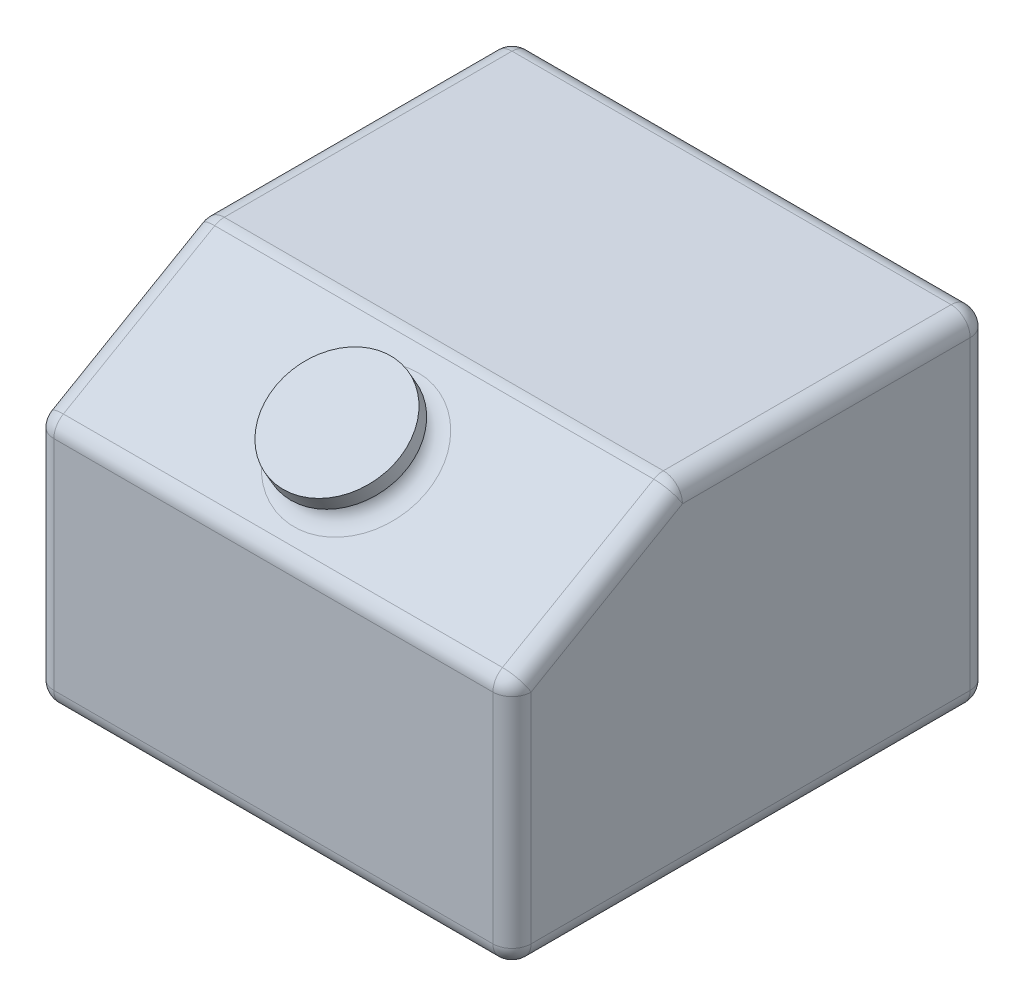
ISO-10303-21;
HEADER;
FILE_DESCRIPTION(('STEP AP214'),'2;1');
FILE_NAME('part.step','',(''),(''),'','','');
FILE_SCHEMA(('AUTOMOTIVE_DESIGN { 1 0 10303 214 1 1 1 1 }'));
ENDSEC;
DATA;
#1=APPLICATION_CONTEXT('core data for automotive mechanical design processes');
#2=APPLICATION_PROTOCOL_DEFINITION('international standard','automotive_design',2000,#1);
#3=PRODUCT_CONTEXT('',#1,'mechanical');
#4=PRODUCT('Part','Part','',(#3));
#5=PRODUCT_RELATED_PRODUCT_CATEGORY('part','',(#4));
#6=PRODUCT_DEFINITION_FORMATION('','',#4);
#7=PRODUCT_DEFINITION_CONTEXT('part definition',#1,'design');
#8=PRODUCT_DEFINITION('design','',#6,#7);
#9=PRODUCT_DEFINITION_SHAPE('','',#8);
#10=(LENGTH_UNIT() NAMED_UNIT(*) SI_UNIT(.MILLI.,.METRE.));
#11=(NAMED_UNIT(*) PLANE_ANGLE_UNIT() SI_UNIT($,.RADIAN.));
#12=(NAMED_UNIT(*) SI_UNIT($,.STERADIAN.) SOLID_ANGLE_UNIT());
#13=UNCERTAINTY_MEASURE_WITH_UNIT(LENGTH_MEASURE(1.E-05),#10,'distance_accuracy_value','');
#14=(GEOMETRIC_REPRESENTATION_CONTEXT(3) GLOBAL_UNCERTAINTY_ASSIGNED_CONTEXT((#13)) GLOBAL_UNIT_ASSIGNED_CONTEXT((#10,
#11,#12)) REPRESENTATION_CONTEXT('',''));
#15=CARTESIAN_POINT('',(0.,0.,0.));
#16=DIRECTION('',(0.,0.,1.));
#17=DIRECTION('',(1.,0.,0.));
#18=AXIS2_PLACEMENT_3D('',#15,#16,#17);
#19=CARTESIAN_POINT('',(125.,172.320508075689,-33.3012701892218));
#20=DIRECTION('',(0.,-0.866025403784438,-0.500000000000001));
#21=DIRECTION('',(0.,0.500000000000001,-0.866025403784438));
#22=AXIS2_PLACEMENT_3D('',#19,#20,#21);
#23=CYLINDRICAL_SURFACE('',#22,27.5);
#24=CARTESIAN_POINT('',(125.,163.660254037844,-38.3012701892219));
#25=DIRECTION('',(0.,-0.866025403784438,-0.500000000000001));
#26=DIRECTION('',(0.,0.500000000000001,-0.866025403784438));
#27=AXIS2_PLACEMENT_3D('',#24,#25,#26);
#28=CIRCLE('',#27,27.5);
#29=CARTESIAN_POINT('',(125.,177.410254037844,-62.116968793294));
#30=VERTEX_POINT('',#29);
#31=EDGE_CURVE('E230',#30,#30,#28,.F.);
#32=ORIENTED_EDGE('',*,*,#31,.T.);
#33=EDGE_LOOP('',(#32));
#34=FACE_BOUND('',#33,.T.);
#35=CARTESIAN_POINT('',(125.,165.392304845413,-37.3012701892219));
#36=DIRECTION('',(0.,0.866025403784438,0.500000000000001));
#37=DIRECTION('',(0.,-0.500000000000001,0.866025403784438));
#38=AXIS2_PLACEMENT_3D('',#35,#36,#37);
#39=CIRCLE('',#38,27.5);
#40=CARTESIAN_POINT('',(125.,151.642304845413,-13.4855715851499));
#41=VERTEX_POINT('',#40);
#42=EDGE_CURVE('E224',#41,#41,#39,.T.);
#43=ORIENTED_EDGE('',*,*,#42,.F.);
#44=EDGE_LOOP('',(#43));
#45=FACE_BOUND('',#44,.T.);
#46=ADVANCED_FACE('F34',(#34,#45),#23,.T.);
#47=CARTESIAN_POINT('',(0.,180.,0.));
#48=DIRECTION('',(1.,0.,0.));
#49=DIRECTION('',(0.,0.,-1.));
#50=AXIS2_PLACEMENT_3D('',#47,#48,#49);
#51=PLANE('',#50);
#52=DIRECTION('',(0.,-0.500000000000001,0.866025403784438));
#53=VECTOR('',#52,1.);
#54=CARTESIAN_POINT('',(0.,171.339745962156,-91.6025403784437));
#55=LINE('',#54,#53);
#56=CARTESIAN_POINT('',(0.,124.226497308104,-10.));
#57=VERTEX_POINT('',#56);
#58=CARTESIAN_POINT('',(0.,170.,-89.2820323027549));
#59=VERTEX_POINT('',#58);
#60=EDGE_CURVE('E260',#57,#59,#55,.F.);
#61=ORIENTED_EDGE('',*,*,#60,.T.);
#62=DIRECTION('',(0.,0.,1.));
#63=VECTOR('',#62,1.);
#64=CARTESIAN_POINT('',(0.,170.,0.));
#65=LINE('',#64,#63);
#66=CARTESIAN_POINT('',(0.,170.,-240.));
#67=VERTEX_POINT('',#66);
#68=EDGE_CURVE('E262',#59,#67,#65,.F.);
#69=ORIENTED_EDGE('',*,*,#68,.T.);
#70=DIRECTION('',(0.,-1.,0.));
#71=VECTOR('',#70,1.);
#72=CARTESIAN_POINT('',(0.,180.,-240.));
#73=LINE('',#72,#71);
#74=CARTESIAN_POINT('',(0.,10.,-240.));
#75=VERTEX_POINT('',#74);
#76=EDGE_CURVE('E258',#67,#75,#73,.T.);
#77=ORIENTED_EDGE('',*,*,#76,.T.);
#78=DIRECTION('',(0.,0.,1.));
#79=VECTOR('',#78,1.);
#80=CARTESIAN_POINT('',(0.,10.,0.));
#81=LINE('',#80,#79);
#82=CARTESIAN_POINT('',(0.,10.,-10.));
#83=VERTEX_POINT('',#82);
#84=EDGE_CURVE('E254',#75,#83,#81,.T.);
#85=ORIENTED_EDGE('',*,*,#84,.T.);
#86=DIRECTION('',(0.,-1.,0.));
#87=VECTOR('',#86,1.);
#88=CARTESIAN_POINT('',(0.,180.,-10.));
#89=LINE('',#88,#87);
#90=EDGE_CURVE('E256',#83,#57,#89,.F.);
#91=ORIENTED_EDGE('',*,*,#90,.T.);
#92=EDGE_LOOP('',(#61,#69,#77,#85,#91));
#93=FACE_BOUND('',#92,.T.);
#94=ADVANCED_FACE('F412',(#93),#51,.F.);
#95=CARTESIAN_POINT('',(0.,180.,0.));
#96=DIRECTION('',(0.,0.,-1.));
#97=DIRECTION('',(-1.,0.,0.));
#98=AXIS2_PLACEMENT_3D('',#95,#96,#97);
#99=PLANE('',#98);
#100=DIRECTION('',(1.,0.,0.));
#101=VECTOR('',#100,1.);
#102=CARTESIAN_POINT('',(0.,124.226497308104,0.));
#103=LINE('',#102,#101);
#104=CARTESIAN_POINT('',(240.,124.226497308104,0.));
#105=VERTEX_POINT('',#104);
#106=CARTESIAN_POINT('',(10.,124.226497308104,0.));
#107=VERTEX_POINT('',#106);
#108=EDGE_CURVE('E289',#105,#107,#103,.F.);
#109=ORIENTED_EDGE('',*,*,#108,.T.);
#110=DIRECTION('',(0.,-1.,0.));
#111=VECTOR('',#110,1.);
#112=CARTESIAN_POINT('',(10.,180.,0.));
#113=LINE('',#112,#111);
#114=CARTESIAN_POINT('',(10.,10.,0.));
#115=VERTEX_POINT('',#114);
#116=EDGE_CURVE('E291',#107,#115,#113,.T.);
#117=ORIENTED_EDGE('',*,*,#116,.T.);
#118=DIRECTION('',(1.,0.,0.));
#119=VECTOR('',#118,1.);
#120=CARTESIAN_POINT('',(250.,10.,0.));
#121=LINE('',#120,#119);
#122=CARTESIAN_POINT('',(240.,10.,0.));
#123=VERTEX_POINT('',#122);
#124=EDGE_CURVE('E285',#115,#123,#121,.T.);
#125=ORIENTED_EDGE('',*,*,#124,.T.);
#126=DIRECTION('',(0.,-1.,0.));
#127=VECTOR('',#126,1.);
#128=CARTESIAN_POINT('',(240.,180.,0.));
#129=LINE('',#128,#127);
#130=EDGE_CURVE('E287',#123,#105,#129,.F.);
#131=ORIENTED_EDGE('',*,*,#130,.T.);
#132=EDGE_LOOP('',(#109,#117,#125,#131));
#133=FACE_BOUND('',#132,.T.);
#134=ADVANCED_FACE('F391',(#133),#99,.F.);
#135=CARTESIAN_POINT('',(250.,180.,0.));
#136=DIRECTION('',(-1.,0.,0.));
#137=DIRECTION('',(0.,0.,1.));
#138=AXIS2_PLACEMENT_3D('',#135,#136,#137);
#139=PLANE('',#138);
#140=DIRECTION('',(0.,-1.,0.));
#141=VECTOR('',#140,1.);
#142=CARTESIAN_POINT('',(250.,180.,-240.));
#143=LINE('',#142,#141);
#144=CARTESIAN_POINT('',(250.,10.,-240.));
#145=VERTEX_POINT('',#144);
#146=CARTESIAN_POINT('',(250.,170.,-240.));
#147=VERTEX_POINT('',#146);
#148=EDGE_CURVE('E280',#145,#147,#143,.F.);
#149=ORIENTED_EDGE('',*,*,#148,.T.);
#150=DIRECTION('',(0.,0.,-1.));
#151=VECTOR('',#150,1.);
#152=CARTESIAN_POINT('',(250.,170.,0.));
#153=LINE('',#152,#151);
#154=CARTESIAN_POINT('',(250.,170.,-89.282032302755));
#155=VERTEX_POINT('',#154);
#156=EDGE_CURVE('E283',#147,#155,#153,.F.);
#157=ORIENTED_EDGE('',*,*,#156,.T.);
#158=DIRECTION('',(0.,0.500000000000001,-0.866025403784438));
#159=VECTOR('',#158,1.);
#160=CARTESIAN_POINT('',(250.,121.339745962156,-5.));
#161=LINE('',#160,#159);
#162=CARTESIAN_POINT('',(250.,124.226497308104,-10.));
#163=VERTEX_POINT('',#162);
#164=EDGE_CURVE('E278',#155,#163,#161,.F.);
#165=ORIENTED_EDGE('',*,*,#164,.T.);
#166=DIRECTION('',(0.,-1.,0.));
#167=VECTOR('',#166,1.);
#168=CARTESIAN_POINT('',(250.,180.,-10.));
#169=LINE('',#168,#167);
#170=CARTESIAN_POINT('',(250.,10.,-10.));
#171=VERTEX_POINT('',#170);
#172=EDGE_CURVE('E276',#163,#171,#169,.T.);
#173=ORIENTED_EDGE('',*,*,#172,.T.);
#174=DIRECTION('',(0.,0.,-1.));
#175=VECTOR('',#174,1.);
#176=CARTESIAN_POINT('',(250.,10.,-250.));
#177=LINE('',#176,#175);
#178=EDGE_CURVE('E274',#171,#145,#177,.T.);
#179=ORIENTED_EDGE('',*,*,#178,.T.);
#180=EDGE_LOOP('',(#149,#157,#165,#173,#179));
#181=FACE_BOUND('',#180,.T.);
#182=ADVANCED_FACE('F489',(#181),#139,.F.);
#183=CARTESIAN_POINT('',(0.,180.,-250.));
#184=DIRECTION('',(0.,0.,1.));
#185=DIRECTION('',(1.,0.,0.));
#186=AXIS2_PLACEMENT_3D('',#183,#184,#185);
#187=PLANE('',#186);
#188=DIRECTION('',(0.,-1.,0.));
#189=VECTOR('',#188,1.);
#190=CARTESIAN_POINT('',(10.,180.,-250.));
#191=LINE('',#190,#189);
#192=CARTESIAN_POINT('',(10.,10.,-250.));
#193=VERTEX_POINT('',#192);
#194=CARTESIAN_POINT('',(10.,170.,-250.));
#195=VERTEX_POINT('',#194);
#196=EDGE_CURVE('E269',#193,#195,#191,.F.);
#197=ORIENTED_EDGE('',*,*,#196,.T.);
#198=DIRECTION('',(-1.,0.,0.));
#199=VECTOR('',#198,1.);
#200=CARTESIAN_POINT('',(0.,170.,-250.));
#201=LINE('',#200,#199);
#202=CARTESIAN_POINT('',(240.,170.,-250.));
#203=VERTEX_POINT('',#202);
#204=EDGE_CURVE('E271',#195,#203,#201,.F.);
#205=ORIENTED_EDGE('',*,*,#204,.T.);
#206=DIRECTION('',(0.,-1.,0.));
#207=VECTOR('',#206,1.);
#208=CARTESIAN_POINT('',(240.,180.,-250.));
#209=LINE('',#208,#207);
#210=CARTESIAN_POINT('',(240.,10.,-250.));
#211=VERTEX_POINT('',#210);
#212=EDGE_CURVE('E267',#203,#211,#209,.T.);
#213=ORIENTED_EDGE('',*,*,#212,.T.);
#214=DIRECTION('',(-1.,0.,0.));
#215=VECTOR('',#214,1.);
#216=CARTESIAN_POINT('',(0.,10.,-250.));
#217=LINE('',#216,#215);
#218=EDGE_CURVE('E265',#211,#193,#217,.T.);
#219=ORIENTED_EDGE('',*,*,#218,.T.);
#220=EDGE_LOOP('',(#197,#205,#213,#219));
#221=FACE_BOUND('',#220,.T.);
#222=ADVANCED_FACE('F484',(#221),#187,.F.);
#223=CARTESIAN_POINT('',(0.,180.,0.));
#224=DIRECTION('',(0.,-1.,0.));
#225=DIRECTION('',(0.,0.,-1.));
#226=AXIS2_PLACEMENT_3D('',#223,#224,#225);
#227=PLANE('',#226);
#228=DIRECTION('',(0.,0.,1.));
#229=VECTOR('',#228,1.);
#230=CARTESIAN_POINT('',(10.,180.,0.));
#231=LINE('',#230,#229);
#232=CARTESIAN_POINT('',(10.,180.,-240.));
#233=VERTEX_POINT('',#232);
#234=CARTESIAN_POINT('',(10.,180.,-89.282032302755));
#235=VERTEX_POINT('',#234);
#236=EDGE_CURVE('E249',#233,#235,#231,.T.);
#237=ORIENTED_EDGE('',*,*,#236,.T.);
#238=DIRECTION('',(-1.,0.,0.));
#239=VECTOR('',#238,1.);
#240=CARTESIAN_POINT('',(250.,180.,-89.282032302755));
#241=LINE('',#240,#239);
#242=CARTESIAN_POINT('',(240.,180.,-89.282032302755));
#243=VERTEX_POINT('',#242);
#244=EDGE_CURVE('E251',#235,#243,#241,.F.);
#245=ORIENTED_EDGE('',*,*,#244,.T.);
#246=DIRECTION('',(0.,0.,-1.));
#247=VECTOR('',#246,1.);
#248=CARTESIAN_POINT('',(240.,180.,0.));
#249=LINE('',#248,#247);
#250=CARTESIAN_POINT('',(240.,180.,-240.));
#251=VERTEX_POINT('',#250);
#252=EDGE_CURVE('E245',#243,#251,#249,.T.);
#253=ORIENTED_EDGE('',*,*,#252,.T.);
#254=DIRECTION('',(-1.,0.,0.));
#255=VECTOR('',#254,1.);
#256=CARTESIAN_POINT('',(0.,180.,-240.));
#257=LINE('',#256,#255);
#258=EDGE_CURVE('E247',#251,#233,#257,.T.);
#259=ORIENTED_EDGE('',*,*,#258,.T.);
#260=EDGE_LOOP('',(#237,#245,#253,#259));
#261=FACE_BOUND('',#260,.T.);
#262=ADVANCED_FACE('F477',(#261),#227,.F.);
#263=CARTESIAN_POINT('',(0.,0.,0.));
#264=DIRECTION('',(0.,-1.,0.));
#265=DIRECTION('',(0.,0.,-1.));
#266=AXIS2_PLACEMENT_3D('',#263,#264,#265);
#267=PLANE('',#266);
#268=DIRECTION('',(0.,0.,-1.));
#269=VECTOR('',#268,1.);
#270=CARTESIAN_POINT('',(240.,0.,0.));
#271=LINE('',#270,#269);
#272=CARTESIAN_POINT('',(240.,0.,-240.));
#273=VERTEX_POINT('',#272);
#274=CARTESIAN_POINT('',(240.,0.,-10.));
#275=VERTEX_POINT('',#274);
#276=EDGE_CURVE('E43',#273,#275,#271,.F.);
#277=ORIENTED_EDGE('',*,*,#276,.T.);
#278=DIRECTION('',(1.,0.,0.));
#279=VECTOR('',#278,1.);
#280=CARTESIAN_POINT('',(0.,0.,-10.));
#281=LINE('',#280,#279);
#282=CARTESIAN_POINT('',(10.,0.,-10.));
#283=VERTEX_POINT('',#282);
#284=EDGE_CURVE('E11',#275,#283,#281,.F.);
#285=ORIENTED_EDGE('',*,*,#284,.T.);
#286=DIRECTION('',(0.,0.,1.));
#287=VECTOR('',#286,1.);
#288=CARTESIAN_POINT('',(10.,0.,-250.));
#289=LINE('',#288,#287);
#290=CARTESIAN_POINT('',(10.,0.,-240.));
#291=VERTEX_POINT('',#290);
#292=EDGE_CURVE('E294',#283,#291,#289,.F.);
#293=ORIENTED_EDGE('',*,*,#292,.T.);
#294=DIRECTION('',(-1.,0.,0.));
#295=VECTOR('',#294,1.);
#296=CARTESIAN_POINT('',(250.,0.,-240.));
#297=LINE('',#296,#295);
#298=EDGE_CURVE('E54',#291,#273,#297,.F.);
#299=ORIENTED_EDGE('',*,*,#298,.T.);
#300=EDGE_LOOP('',(#277,#285,#293,#299));
#301=FACE_BOUND('',#300,.T.);
#302=ADVANCED_FACE('F514',(#301),#267,.T.);
#303=CARTESIAN_POINT('',(0.,180.,-86.6025403784437));
#304=DIRECTION('',(0.,-0.866025403784438,-0.500000000000001));
#305=DIRECTION('',(1.,0.,0.));
#306=AXIS2_PLACEMENT_3D('',#303,#304,#305);
#307=PLANE('',#306);
#308=CARTESIAN_POINT('',(125.,155.,-43.301270189222));
#309=DIRECTION('',(0.,-0.866025403784438,-0.500000000000001));
#310=DIRECTION('',(0.,0.500000000000001,-0.866025403784438));
#311=AXIS2_PLACEMENT_3D('',#308,#309,#310);
#312=CIRCLE('',#311,37.5);
#313=CARTESIAN_POINT('',(125.,173.75,-75.7772228311384));
#314=VERTEX_POINT('',#313);
#315=EDGE_CURVE('E242',#314,#314,#312,.T.);
#316=ORIENTED_EDGE('',*,*,#315,.T.);
#317=EDGE_LOOP('',(#316));
#318=FACE_BOUND('',#317,.T.);
#319=DIRECTION('',(0.,-0.500000000000001,0.866025403784438));
#320=VECTOR('',#319,1.);
#321=CARTESIAN_POINT('',(240.,180.,-86.6025403784437));
#322=LINE('',#321,#320);
#323=CARTESIAN_POINT('',(240.,132.886751345948,-4.99999999999998));
#324=VERTEX_POINT('',#323);
#325=CARTESIAN_POINT('',(240.,178.660254037844,-84.2820323027549));
#326=VERTEX_POINT('',#325);
#327=EDGE_CURVE('E235',#324,#326,#322,.F.);
#328=ORIENTED_EDGE('',*,*,#327,.T.);
#329=DIRECTION('',(1.,0.,0.));
#330=VECTOR('',#329,1.);
#331=CARTESIAN_POINT('',(0.,178.660254037844,-84.2820323027549));
#332=LINE('',#331,#330);
#333=CARTESIAN_POINT('',(10.,178.660254037844,-84.2820323027549));
#334=VERTEX_POINT('',#333);
#335=EDGE_CURVE('E239',#326,#334,#332,.F.);
#336=ORIENTED_EDGE('',*,*,#335,.T.);
#337=DIRECTION('',(0.,0.500000000000001,-0.866025403784438));
#338=VECTOR('',#337,1.);
#339=CARTESIAN_POINT('',(10.,130.,0.));
#340=LINE('',#339,#338);
#341=CARTESIAN_POINT('',(10.,132.886751345948,-4.99999999999998));
#342=VERTEX_POINT('',#341);
#343=EDGE_CURVE('E237',#334,#342,#340,.F.);
#344=ORIENTED_EDGE('',*,*,#343,.T.);
#345=DIRECTION('',(-1.,0.,0.));
#346=VECTOR('',#345,1.);
#347=CARTESIAN_POINT('',(250.,132.886751345948,-4.99999999999998));
#348=LINE('',#347,#346);
#349=EDGE_CURVE('E233',#342,#324,#348,.F.);
#350=ORIENTED_EDGE('',*,*,#349,.T.);
#351=EDGE_LOOP('',(#328,#336,#344,#350));
#352=FACE_BOUND('',#351,.T.);
#353=ADVANCED_FACE('F463',(#318,#352),#307,.F.);
#354=CARTESIAN_POINT('',(125.,165.392304845413,-37.3012701892219));
#355=DIRECTION('',(0.,0.866025403784438,0.500000000000001));
#356=DIRECTION('',(0.,-0.500000000000001,0.866025403784438));
#357=AXIS2_PLACEMENT_3D('',#354,#355,#356);
#358=CYLINDRICAL_SURFACE('',#357,32.5);
#359=CARTESIAN_POINT('',(125.,165.392304845413,-37.3012701892219));
#360=DIRECTION('',(0.,0.866025403784438,0.500000000000001));
#361=DIRECTION('',(0.,-0.500000000000001,0.866025403784438));
#362=AXIS2_PLACEMENT_3D('',#359,#360,#361);
#363=CIRCLE('',#362,32.5);
#364=CARTESIAN_POINT('',(125.,149.142304845413,-9.15544456622765));
#365=VERTEX_POINT('',#364);
#366=EDGE_CURVE('E221',#365,#365,#363,.T.);
#367=ORIENTED_EDGE('',*,*,#366,.T.);
#368=EDGE_LOOP('',(#367));
#369=FACE_BOUND('',#368,.T.);
#370=CARTESIAN_POINT('',(125.,172.320508075689,-33.3012701892219));
#371=DIRECTION('',(0.,0.866025403784438,0.500000000000001));
#372=DIRECTION('',(0.,-0.500000000000001,0.866025403784438));
#373=AXIS2_PLACEMENT_3D('',#370,#371,#372);
#374=CIRCLE('',#373,32.5);
#375=CARTESIAN_POINT('',(125.,156.070508075689,-5.15544456622764));
#376=VERTEX_POINT('',#375);
#377=EDGE_CURVE('E225',#376,#376,#374,.T.);
#378=ORIENTED_EDGE('',*,*,#377,.F.);
#379=EDGE_LOOP('',(#378));
#380=FACE_BOUND('',#379,.T.);
#381=ADVANCED_FACE('F525',(#369,#380),#358,.T.);
#382=CARTESIAN_POINT('',(125.,165.392304845413,-37.3012701892219));
#383=DIRECTION('',(0.,0.866025403784438,0.500000000000001));
#384=DIRECTION('',(0.,-0.500000000000001,0.866025403784438));
#385=AXIS2_PLACEMENT_3D('',#382,#383,#384);
#386=PLANE('',#385);
#387=ORIENTED_EDGE('',*,*,#42,.T.);
#388=EDGE_LOOP('',(#387));
#389=FACE_BOUND('',#388,.T.);
#390=ORIENTED_EDGE('',*,*,#366,.F.);
#391=EDGE_LOOP('',(#390));
#392=FACE_BOUND('',#391,.T.);
#393=ADVANCED_FACE('F784',(#389,#392),#386,.F.);
#394=CARTESIAN_POINT('',(0.,114.820508075689,66.2916512459886));
#395=DIRECTION('',(0.,0.866025403784438,0.500000000000001));
#396=DIRECTION('',(0.,-0.500000000000001,0.866025403784438));
#397=AXIS2_PLACEMENT_3D('',#394,#395,#396);
#398=PLANE('',#397);
#399=ORIENTED_EDGE('',*,*,#377,.T.);
#400=EDGE_LOOP('',(#399));
#401=FACE_BOUND('',#400,.T.);
#402=ADVANCED_FACE('F510',(#401),#398,.T.);
#403=CARTESIAN_POINT('',(125.,163.660254037844,-38.3012701892219));
#404=DIRECTION('',(0.,-0.866025403784438,-0.500000000000001));
#405=DIRECTION('',(0.,0.500000000000001,-0.866025403784438));
#406=AXIS2_PLACEMENT_3D('',#403,#404,#405);
#407=TOROIDAL_SURFACE('',#406,37.5,10.);
#408=ORIENTED_EDGE('',*,*,#315,.F.);
#409=EDGE_LOOP('',(#408));
#410=FACE_BOUND('',#409,.T.);
#411=ORIENTED_EDGE('',*,*,#31,.F.);
#412=EDGE_LOOP('',(#411));
#413=FACE_BOUND('',#412,.T.);
#414=ADVANCED_FACE('F527',(#410,#413),#407,.F.);
#415=CARTESIAN_POINT('',(10.,10.,0.));
#416=DIRECTION('',(0.,0.,-1.));
#417=DIRECTION('',(-1.,0.,0.));
#418=AXIS2_PLACEMENT_3D('',#415,#416,#417);
#419=CYLINDRICAL_SURFACE('',#418,10.);
#420=CARTESIAN_POINT('',(10.,10.,-240.));
#421=DIRECTION('',(0.,0.,-1.));
#422=DIRECTION('',(-1.,0.,0.));
#423=AXIS2_PLACEMENT_3D('',#420,#421,#422);
#424=CIRCLE('',#423,10.);
#425=EDGE_CURVE('E373',#291,#75,#424,.T.);
#426=ORIENTED_EDGE('',*,*,#425,.F.);
#427=ORIENTED_EDGE('',*,*,#292,.F.);
#428=CARTESIAN_POINT('',(10.,10.,-10.));
#429=DIRECTION('',(0.,0.,1.));
#430=DIRECTION('',(1.,0.,0.));
#431=AXIS2_PLACEMENT_3D('',#428,#429,#430);
#432=CIRCLE('',#431,10.);
#433=EDGE_CURVE('E375',#83,#283,#432,.T.);
#434=ORIENTED_EDGE('',*,*,#433,.F.);
#435=ORIENTED_EDGE('',*,*,#84,.F.);
#436=EDGE_LOOP('',(#426,#427,#434,#435));
#437=FACE_BOUND('',#436,.T.);
#438=ADVANCED_FACE('F36',(#437),#419,.T.);
#439=CARTESIAN_POINT('',(0.,10.,-240.));
#440=DIRECTION('',(1.,0.,0.));
#441=DIRECTION('',(0.,0.,-1.));
#442=AXIS2_PLACEMENT_3D('',#439,#440,#441);
#443=CYLINDRICAL_SURFACE('',#442,10.);
#444=CARTESIAN_POINT('',(240.,10.,-240.));
#445=DIRECTION('',(1.,0.,0.));
#446=DIRECTION('',(0.,0.,-1.));
#447=AXIS2_PLACEMENT_3D('',#444,#445,#446);
#448=CIRCLE('',#447,10.);
#449=EDGE_CURVE('E367',#273,#211,#448,.T.);
#450=ORIENTED_EDGE('',*,*,#449,.F.);
#451=ORIENTED_EDGE('',*,*,#298,.F.);
#452=CARTESIAN_POINT('',(10.,10.,-240.));
#453=DIRECTION('',(-1.,0.,0.));
#454=DIRECTION('',(0.,0.,1.));
#455=AXIS2_PLACEMENT_3D('',#452,#453,#454);
#456=CIRCLE('',#455,10.);
#457=EDGE_CURVE('E370',#193,#291,#456,.T.);
#458=ORIENTED_EDGE('',*,*,#457,.F.);
#459=ORIENTED_EDGE('',*,*,#218,.F.);
#460=EDGE_LOOP('',(#450,#451,#458,#459));
#461=FACE_BOUND('',#460,.T.);
#462=ADVANCED_FACE('F437',(#461),#443,.T.);
#463=CARTESIAN_POINT('',(240.,10.,0.));
#464=DIRECTION('',(0.,0.,1.));
#465=DIRECTION('',(1.,0.,0.));
#466=AXIS2_PLACEMENT_3D('',#463,#464,#465);
#467=CYLINDRICAL_SURFACE('',#466,10.);
#468=CARTESIAN_POINT('',(240.,10.,-10.));
#469=DIRECTION('',(0.,0.,1.));
#470=DIRECTION('',(1.,0.,0.));
#471=AXIS2_PLACEMENT_3D('',#468,#469,#470);
#472=CIRCLE('',#471,10.);
#473=EDGE_CURVE('E361',#275,#171,#472,.T.);
#474=ORIENTED_EDGE('',*,*,#473,.F.);
#475=ORIENTED_EDGE('',*,*,#276,.F.);
#476=CARTESIAN_POINT('',(240.,10.,-240.));
#477=DIRECTION('',(0.,0.,-1.));
#478=DIRECTION('',(-1.,0.,0.));
#479=AXIS2_PLACEMENT_3D('',#476,#477,#478);
#480=CIRCLE('',#479,10.);
#481=EDGE_CURVE('E364',#145,#273,#480,.T.);
#482=ORIENTED_EDGE('',*,*,#481,.F.);
#483=ORIENTED_EDGE('',*,*,#178,.F.);
#484=EDGE_LOOP('',(#474,#475,#482,#483));
#485=FACE_BOUND('',#484,.T.);
#486=ADVANCED_FACE('F446',(#485),#467,.T.);
#487=CARTESIAN_POINT('',(0.,10.,-10.));
#488=DIRECTION('',(-1.,0.,0.));
#489=DIRECTION('',(0.,0.,1.));
#490=AXIS2_PLACEMENT_3D('',#487,#488,#489);
#491=CYLINDRICAL_SURFACE('',#490,10.);
#492=CARTESIAN_POINT('',(10.,10.,-10.));
#493=DIRECTION('',(-1.,0.,0.));
#494=DIRECTION('',(0.,0.,1.));
#495=AXIS2_PLACEMENT_3D('',#492,#493,#494);
#496=CIRCLE('',#495,10.);
#497=EDGE_CURVE('E38',#283,#115,#496,.T.);
#498=ORIENTED_EDGE('',*,*,#497,.F.);
#499=ORIENTED_EDGE('',*,*,#284,.F.);
#500=CARTESIAN_POINT('',(240.,10.,-10.));
#501=DIRECTION('',(1.,0.,0.));
#502=DIRECTION('',(0.,0.,-1.));
#503=AXIS2_PLACEMENT_3D('',#500,#501,#502);
#504=CIRCLE('',#503,10.);
#505=EDGE_CURVE('E358',#123,#275,#504,.T.);
#506=ORIENTED_EDGE('',*,*,#505,.F.);
#507=ORIENTED_EDGE('',*,*,#124,.F.);
#508=EDGE_LOOP('',(#498,#499,#506,#507));
#509=FACE_BOUND('',#508,.T.);
#510=ADVANCED_FACE('F387',(#509),#491,.T.);
#511=CARTESIAN_POINT('',(10.,10.,-10.));
#512=DIRECTION('',(0.,0.,1.));
#513=DIRECTION('',(1.,0.,0.));
#514=AXIS2_PLACEMENT_3D('',#511,#512,#513);
#515=SPHERICAL_SURFACE('',#514,10.);
#516=ORIENTED_EDGE('',*,*,#433,.T.);
#517=ORIENTED_EDGE('',*,*,#497,.T.);
#518=CARTESIAN_POINT('',(10.,10.,-10.));
#519=DIRECTION('',(0.,-1.,0.));
#520=DIRECTION('',(0.,0.,-1.));
#521=AXIS2_PLACEMENT_3D('',#518,#519,#520);
#522=CIRCLE('',#521,10.);
#523=EDGE_CURVE('E356',#83,#115,#522,.F.);
#524=ORIENTED_EDGE('',*,*,#523,.F.);
#525=EDGE_LOOP('',(#516,#517,#524));
#526=FACE_BOUND('',#525,.T.);
#527=ADVANCED_FACE('F382',(#526),#515,.T.);
#528=CARTESIAN_POINT('',(10.,10.,-240.));
#529=DIRECTION('',(0.,0.,1.));
#530=DIRECTION('',(1.,0.,0.));
#531=AXIS2_PLACEMENT_3D('',#528,#529,#530);
#532=SPHERICAL_SURFACE('',#531,10.);
#533=ORIENTED_EDGE('',*,*,#457,.T.);
#534=ORIENTED_EDGE('',*,*,#425,.T.);
#535=CARTESIAN_POINT('',(10.,10.,-240.));
#536=DIRECTION('',(0.,-1.,0.));
#537=DIRECTION('',(0.,0.,-1.));
#538=AXIS2_PLACEMENT_3D('',#535,#536,#537);
#539=CIRCLE('',#538,10.);
#540=EDGE_CURVE('E353',#193,#75,#539,.F.);
#541=ORIENTED_EDGE('',*,*,#540,.F.);
#542=EDGE_LOOP('',(#533,#534,#541));
#543=FACE_BOUND('',#542,.T.);
#544=ADVANCED_FACE('F432',(#543),#532,.T.);
#545=CARTESIAN_POINT('',(240.,10.,-240.));
#546=DIRECTION('',(0.,0.,1.));
#547=DIRECTION('',(1.,0.,0.));
#548=AXIS2_PLACEMENT_3D('',#545,#546,#547);
#549=SPHERICAL_SURFACE('',#548,10.);
#550=ORIENTED_EDGE('',*,*,#481,.T.);
#551=ORIENTED_EDGE('',*,*,#449,.T.);
#552=CARTESIAN_POINT('',(240.,10.,-240.));
#553=DIRECTION('',(0.,-1.,0.));
#554=DIRECTION('',(0.,0.,-1.));
#555=AXIS2_PLACEMENT_3D('',#552,#553,#554);
#556=CIRCLE('',#555,10.);
#557=EDGE_CURVE('E350',#145,#211,#556,.F.);
#558=ORIENTED_EDGE('',*,*,#557,.F.);
#559=EDGE_LOOP('',(#550,#551,#558));
#560=FACE_BOUND('',#559,.T.);
#561=ADVANCED_FACE('F441',(#560),#549,.T.);
#562=CARTESIAN_POINT('',(240.,10.,-10.));
#563=DIRECTION('',(0.,0.,1.));
#564=DIRECTION('',(1.,0.,0.));
#565=AXIS2_PLACEMENT_3D('',#562,#563,#564);
#566=SPHERICAL_SURFACE('',#565,10.);
#567=ORIENTED_EDGE('',*,*,#505,.T.);
#568=ORIENTED_EDGE('',*,*,#473,.T.);
#569=CARTESIAN_POINT('',(240.,10.,-10.));
#570=DIRECTION('',(0.,-1.,0.));
#571=DIRECTION('',(0.,0.,-1.));
#572=AXIS2_PLACEMENT_3D('',#569,#570,#571);
#573=CIRCLE('',#572,10.);
#574=EDGE_CURVE('E347',#123,#171,#573,.F.);
#575=ORIENTED_EDGE('',*,*,#574,.F.);
#576=EDGE_LOOP('',(#567,#568,#575));
#577=FACE_BOUND('',#576,.T.);
#578=ADVANCED_FACE('F448',(#577),#566,.T.);
#579=CARTESIAN_POINT('',(10.,180.,-10.));
#580=DIRECTION('',(0.,-1.,0.));
#581=DIRECTION('',(0.,0.,-1.));
#582=AXIS2_PLACEMENT_3D('',#579,#580,#581);
#583=CYLINDRICAL_SURFACE('',#582,10.);
#584=ORIENTED_EDGE('',*,*,#523,.T.);
#585=ORIENTED_EDGE('',*,*,#116,.F.);
#586=CARTESIAN_POINT('',(10.,124.226497308104,-10.));
#587=DIRECTION('',(0.,1.,0.));
#588=DIRECTION('',(0.,0.,1.));
#589=AXIS2_PLACEMENT_3D('',#586,#587,#588);
#590=CIRCLE('',#589,10.);
#591=EDGE_CURVE('E341',#57,#107,#590,.T.);
#592=ORIENTED_EDGE('',*,*,#591,.F.);
#593=ORIENTED_EDGE('',*,*,#90,.F.);
#594=EDGE_LOOP('',(#584,#585,#592,#593));
#595=FACE_BOUND('',#594,.T.);
#596=ADVANCED_FACE('F396',(#595),#583,.T.);
#597=CARTESIAN_POINT('',(10.,180.,-240.));
#598=DIRECTION('',(0.,-1.,0.));
#599=DIRECTION('',(0.,0.,-1.));
#600=AXIS2_PLACEMENT_3D('',#597,#598,#599);
#601=CYLINDRICAL_SURFACE('',#600,10.);
#602=ORIENTED_EDGE('',*,*,#540,.T.);
#603=ORIENTED_EDGE('',*,*,#76,.F.);
#604=CARTESIAN_POINT('',(10.,170.,-240.));
#605=DIRECTION('',(0.,1.,0.));
#606=DIRECTION('',(0.,0.,1.));
#607=AXIS2_PLACEMENT_3D('',#604,#605,#606);
#608=CIRCLE('',#607,10.);
#609=EDGE_CURVE('E338',#195,#67,#608,.T.);
#610=ORIENTED_EDGE('',*,*,#609,.F.);
#611=ORIENTED_EDGE('',*,*,#196,.F.);
#612=EDGE_LOOP('',(#602,#603,#610,#611));
#613=FACE_BOUND('',#612,.T.);
#614=ADVANCED_FACE('F426',(#613),#601,.T.);
#615=CARTESIAN_POINT('',(0.,170.,-240.));
#616=DIRECTION('',(-1.,0.,0.));
#617=DIRECTION('',(0.,0.,1.));
#618=AXIS2_PLACEMENT_3D('',#615,#616,#617);
#619=CYLINDRICAL_SURFACE('',#618,10.);
#620=CARTESIAN_POINT('',(240.,170.,-240.));
#621=DIRECTION('',(1.,0.,0.));
#622=DIRECTION('',(0.,0.,-1.));
#623=AXIS2_PLACEMENT_3D('',#620,#621,#622);
#624=CIRCLE('',#623,10.);
#625=EDGE_CURVE('E332',#203,#251,#624,.T.);
#626=ORIENTED_EDGE('',*,*,#625,.F.);
#627=ORIENTED_EDGE('',*,*,#204,.F.);
#628=CARTESIAN_POINT('',(10.,170.,-240.));
#629=DIRECTION('',(-1.,0.,0.));
#630=DIRECTION('',(0.,0.,1.));
#631=AXIS2_PLACEMENT_3D('',#628,#629,#630);
#632=CIRCLE('',#631,10.);
#633=EDGE_CURVE('E335',#233,#195,#632,.T.);
#634=ORIENTED_EDGE('',*,*,#633,.F.);
#635=ORIENTED_EDGE('',*,*,#258,.F.);
#636=EDGE_LOOP('',(#626,#627,#634,#635));
#637=FACE_BOUND('',#636,.T.);
#638=ADVANCED_FACE('F481',(#637),#619,.T.);
#639=CARTESIAN_POINT('',(240.,180.,-240.));
#640=DIRECTION('',(0.,-1.,0.));
#641=DIRECTION('',(0.,0.,-1.));
#642=AXIS2_PLACEMENT_3D('',#639,#640,#641);
#643=CYLINDRICAL_SURFACE('',#642,10.);
#644=ORIENTED_EDGE('',*,*,#557,.T.);
#645=ORIENTED_EDGE('',*,*,#212,.F.);
#646=CARTESIAN_POINT('',(240.,170.,-240.));
#647=DIRECTION('',(0.,1.,0.));
#648=DIRECTION('',(0.,0.,1.));
#649=AXIS2_PLACEMENT_3D('',#646,#647,#648);
#650=CIRCLE('',#649,10.);
#651=EDGE_CURVE('E330',#147,#203,#650,.T.);
#652=ORIENTED_EDGE('',*,*,#651,.F.);
#653=ORIENTED_EDGE('',*,*,#148,.F.);
#654=EDGE_LOOP('',(#644,#645,#652,#653));
#655=FACE_BOUND('',#654,.T.);
#656=ADVANCED_FACE('F487',(#655),#643,.T.);
#657=CARTESIAN_POINT('',(240.,180.,-10.));
#658=DIRECTION('',(0.,-1.,0.));
#659=DIRECTION('',(0.,0.,-1.));
#660=AXIS2_PLACEMENT_3D('',#657,#658,#659);
#661=CYLINDRICAL_SURFACE('',#660,10.);
#662=ORIENTED_EDGE('',*,*,#574,.T.);
#663=ORIENTED_EDGE('',*,*,#172,.F.);
#664=CARTESIAN_POINT('',(240.,124.226497308104,-10.));
#665=DIRECTION('',(0.,1.,0.));
#666=DIRECTION('',(-1.,0.,0.));
#667=AXIS2_PLACEMENT_3D('',#664,#665,#666);
#668=CIRCLE('',#667,10.);
#669=EDGE_CURVE('E327',#105,#163,#668,.T.);
#670=ORIENTED_EDGE('',*,*,#669,.F.);
#671=ORIENTED_EDGE('',*,*,#130,.F.);
#672=EDGE_LOOP('',(#662,#663,#670,#671));
#673=FACE_BOUND('',#672,.T.);
#674=ADVANCED_FACE('F452',(#673),#661,.T.);
#675=CARTESIAN_POINT('',(0.,124.226497308104,-10.));
#676=DIRECTION('',(-1.,0.,0.));
#677=DIRECTION('',(0.,0.,1.));
#678=AXIS2_PLACEMENT_3D('',#675,#676,#677);
#679=CYLINDRICAL_SURFACE('',#678,10.);
#680=CARTESIAN_POINT('',(10.,124.226497308104,-10.));
#681=DIRECTION('',(-1.,0.,0.));
#682=DIRECTION('',(0.,-1.,0.));
#683=AXIS2_PLACEMENT_3D('',#680,#681,#682);
#684=CIRCLE('',#683,10.);
#685=EDGE_CURVE('E344',#107,#342,#684,.T.);
#686=ORIENTED_EDGE('',*,*,#685,.F.);
#687=ORIENTED_EDGE('',*,*,#108,.F.);
#688=CARTESIAN_POINT('',(240.,124.226497308104,-9.99999999999999));
#689=DIRECTION('',(1.,0.,0.));
#690=DIRECTION('',(0.,0.,-1.));
#691=AXIS2_PLACEMENT_3D('',#688,#689,#690);
#692=CIRCLE('',#691,10.);
#693=EDGE_CURVE('E324',#324,#105,#692,.T.);
#694=ORIENTED_EDGE('',*,*,#693,.F.);
#695=ORIENTED_EDGE('',*,*,#349,.F.);
#696=EDGE_LOOP('',(#686,#687,#694,#695));
#697=FACE_BOUND('',#696,.T.);
#698=ADVANCED_FACE('F400',(#697),#679,.T.);
#699=CARTESIAN_POINT('',(10.,124.226497308104,-10.));
#700=DIRECTION('',(0.,0.,1.));
#701=DIRECTION('',(1.,0.,0.));
#702=AXIS2_PLACEMENT_3D('',#699,#700,#701);
#703=SPHERICAL_SURFACE('',#702,10.);
#704=ORIENTED_EDGE('',*,*,#591,.T.);
#705=ORIENTED_EDGE('',*,*,#685,.T.);
#706=CARTESIAN_POINT('',(10.,124.226497308104,-9.99999999999999));
#707=DIRECTION('',(0.,-0.500000000000002,0.866025403784438));
#708=DIRECTION('',(0.,-0.866025403784438,-0.500000000000002));
#709=AXIS2_PLACEMENT_3D('',#706,#707,#708);
#710=CIRCLE('',#709,10.);
#711=EDGE_CURVE('E321',#57,#342,#710,.F.);
#712=ORIENTED_EDGE('',*,*,#711,.F.);
#713=EDGE_LOOP('',(#704,#705,#712));
#714=FACE_BOUND('',#713,.T.);
#715=ADVANCED_FACE('F404',(#714),#703,.T.);
#716=CARTESIAN_POINT('',(10.,170.,-240.));
#717=DIRECTION('',(0.,0.,1.));
#718=DIRECTION('',(1.,0.,0.));
#719=AXIS2_PLACEMENT_3D('',#716,#717,#718);
#720=SPHERICAL_SURFACE('',#719,10.);
#721=ORIENTED_EDGE('',*,*,#633,.T.);
#722=ORIENTED_EDGE('',*,*,#609,.T.);
#723=CARTESIAN_POINT('',(10.,170.,-240.));
#724=DIRECTION('',(0.,0.,-1.));
#725=DIRECTION('',(-1.,0.,0.));
#726=AXIS2_PLACEMENT_3D('',#723,#724,#725);
#727=CIRCLE('',#726,10.);
#728=EDGE_CURVE('E319',#233,#67,#727,.F.);
#729=ORIENTED_EDGE('',*,*,#728,.F.);
#730=EDGE_LOOP('',(#721,#722,#729));
#731=FACE_BOUND('',#730,.T.);
#732=ADVANCED_FACE('F422',(#731),#720,.T.);
#733=CARTESIAN_POINT('',(240.,170.,-240.));
#734=DIRECTION('',(0.,0.,1.));
#735=DIRECTION('',(1.,0.,0.));
#736=AXIS2_PLACEMENT_3D('',#733,#734,#735);
#737=SPHERICAL_SURFACE('',#736,10.);
#738=ORIENTED_EDGE('',*,*,#651,.T.);
#739=ORIENTED_EDGE('',*,*,#625,.T.);
#740=CARTESIAN_POINT('',(240.,170.,-240.));
#741=DIRECTION('',(0.,0.,-1.));
#742=DIRECTION('',(-1.,0.,0.));
#743=AXIS2_PLACEMENT_3D('',#740,#741,#742);
#744=CIRCLE('',#743,10.);
#745=EDGE_CURVE('E316',#147,#251,#744,.F.);
#746=ORIENTED_EDGE('',*,*,#745,.F.);
#747=EDGE_LOOP('',(#738,#739,#746));
#748=FACE_BOUND('',#747,.T.);
#749=ADVANCED_FACE('F491',(#748),#737,.T.);
#750=CARTESIAN_POINT('',(240.,124.226497308104,-10.));
#751=DIRECTION('',(0.,0.,1.));
#752=DIRECTION('',(1.,0.,0.));
#753=AXIS2_PLACEMENT_3D('',#750,#751,#752);
#754=SPHERICAL_SURFACE('',#753,10.);
#755=ORIENTED_EDGE('',*,*,#693,.T.);
#756=ORIENTED_EDGE('',*,*,#669,.T.);
#757=CARTESIAN_POINT('',(240.,124.226497308104,-10.));
#758=DIRECTION('',(0.,-0.500000000000002,0.866025403784437));
#759=DIRECTION('',(0.,-0.866025403784437,-0.500000000000002));
#760=AXIS2_PLACEMENT_3D('',#757,#758,#759);
#761=CIRCLE('',#760,10.);
#762=EDGE_CURVE('E313',#324,#163,#761,.F.);
#763=ORIENTED_EDGE('',*,*,#762,.F.);
#764=EDGE_LOOP('',(#755,#756,#763));
#765=FACE_BOUND('',#764,.T.);
#766=ADVANCED_FACE('F455',(#765),#754,.T.);
#767=CARTESIAN_POINT('',(10.,133.839745962156,-26.6506350946111));
#768=DIRECTION('',(0.,0.500000000000001,-0.866025403784438));
#769=DIRECTION('',(0.,0.866025403784438,0.500000000000001));
#770=AXIS2_PLACEMENT_3D('',#767,#768,#769);
#771=CYLINDRICAL_SURFACE('',#770,10.);
#772=ORIENTED_EDGE('',*,*,#711,.T.);
#773=ORIENTED_EDGE('',*,*,#343,.F.);
#774=CARTESIAN_POINT('',(10.,170.,-89.2820323027549));
#775=DIRECTION('',(0.,0.500000000000001,-0.866025403784438));
#776=DIRECTION('',(0.,0.866025403784438,0.500000000000001));
#777=AXIS2_PLACEMENT_3D('',#774,#775,#776);
#778=CIRCLE('',#777,10.);
#779=EDGE_CURVE('E310',#59,#334,#778,.T.);
#780=ORIENTED_EDGE('',*,*,#779,.F.);
#781=ORIENTED_EDGE('',*,*,#60,.F.);
#782=EDGE_LOOP('',(#772,#773,#780,#781));
#783=FACE_BOUND('',#782,.T.);
#784=ADVANCED_FACE('F409',(#783),#771,.T.);
#785=CARTESIAN_POINT('',(10.,170.,0.));
#786=DIRECTION('',(0.,0.,1.));
#787=DIRECTION('',(1.,0.,0.));
#788=AXIS2_PLACEMENT_3D('',#785,#786,#787);
#789=CYLINDRICAL_SURFACE('',#788,10.);
#790=ORIENTED_EDGE('',*,*,#728,.T.);
#791=ORIENTED_EDGE('',*,*,#68,.F.);
#792=CARTESIAN_POINT('',(10.,170.,-89.282032302755));
#793=DIRECTION('',(0.,0.,1.));
#794=DIRECTION('',(1.,0.,0.));
#795=AXIS2_PLACEMENT_3D('',#792,#793,#794);
#796=CIRCLE('',#795,10.);
#797=EDGE_CURVE('E307',#235,#59,#796,.T.);
#798=ORIENTED_EDGE('',*,*,#797,.F.);
#799=ORIENTED_EDGE('',*,*,#236,.F.);
#800=EDGE_LOOP('',(#790,#791,#798,#799));
#801=FACE_BOUND('',#800,.T.);
#802=ADVANCED_FACE('F415',(#801),#789,.T.);
#803=CARTESIAN_POINT('',(240.,170.,0.));
#804=DIRECTION('',(0.,0.,-1.));
#805=DIRECTION('',(-1.,0.,0.));
#806=AXIS2_PLACEMENT_3D('',#803,#804,#805);
#807=CYLINDRICAL_SURFACE('',#806,10.);
#808=ORIENTED_EDGE('',*,*,#745,.T.);
#809=ORIENTED_EDGE('',*,*,#252,.F.);
#810=CARTESIAN_POINT('',(240.,170.,-89.282032302755));
#811=DIRECTION('',(0.,0.,1.));
#812=DIRECTION('',(1.,0.,0.));
#813=AXIS2_PLACEMENT_3D('',#810,#811,#812);
#814=CIRCLE('',#813,10.);
#815=EDGE_CURVE('E304',#155,#243,#814,.T.);
#816=ORIENTED_EDGE('',*,*,#815,.F.);
#817=ORIENTED_EDGE('',*,*,#156,.F.);
#818=EDGE_LOOP('',(#808,#809,#816,#817));
#819=FACE_BOUND('',#818,.T.);
#820=ADVANCED_FACE('F473',(#819),#807,.T.);
#821=CARTESIAN_POINT('',(240.,133.839745962156,-26.6506350946111));
#822=DIRECTION('',(0.,-0.500000000000001,0.866025403784438));
#823=DIRECTION('',(0.,-0.866025403784438,-0.500000000000001));
#824=AXIS2_PLACEMENT_3D('',#821,#822,#823);
#825=CYLINDRICAL_SURFACE('',#824,10.);
#826=ORIENTED_EDGE('',*,*,#762,.T.);
#827=ORIENTED_EDGE('',*,*,#164,.F.);
#828=CARTESIAN_POINT('',(240.,170.,-89.282032302755));
#829=DIRECTION('',(0.,0.500000000000002,-0.866025403784437));
#830=DIRECTION('',(0.,0.866025403784438,0.500000000000002));
#831=AXIS2_PLACEMENT_3D('',#828,#829,#830);
#832=CIRCLE('',#831,10.);
#833=EDGE_CURVE('E301',#326,#155,#832,.T.);
#834=ORIENTED_EDGE('',*,*,#833,.F.);
#835=ORIENTED_EDGE('',*,*,#327,.F.);
#836=EDGE_LOOP('',(#826,#827,#834,#835));
#837=FACE_BOUND('',#836,.T.);
#838=ADVANCED_FACE('F460',(#837),#825,.T.);
#839=CARTESIAN_POINT('',(10.,170.,-89.282032302755));
#840=DIRECTION('',(0.,0.,1.));
#841=DIRECTION('',(1.,0.,0.));
#842=AXIS2_PLACEMENT_3D('',#839,#840,#841);
#843=SPHERICAL_SURFACE('',#842,10.);
#844=ORIENTED_EDGE('',*,*,#797,.T.);
#845=ORIENTED_EDGE('',*,*,#779,.T.);
#846=CARTESIAN_POINT('',(10.,170.,-89.282032302755));
#847=DIRECTION('',(-1.,0.,0.));
#848=DIRECTION('',(0.,0.,1.));
#849=AXIS2_PLACEMENT_3D('',#846,#847,#848);
#850=CIRCLE('',#849,10.);
#851=EDGE_CURVE('E299',#235,#334,#850,.F.);
#852=ORIENTED_EDGE('',*,*,#851,.F.);
#853=EDGE_LOOP('',(#844,#845,#852));
#854=FACE_BOUND('',#853,.T.);
#855=ADVANCED_FACE('F535',(#854),#843,.T.);
#856=CARTESIAN_POINT('',(240.,170.,-89.282032302755));
#857=DIRECTION('',(0.,0.,1.));
#858=DIRECTION('',(1.,0.,0.));
#859=AXIS2_PLACEMENT_3D('',#856,#857,#858);
#860=SPHERICAL_SURFACE('',#859,10.);
#861=ORIENTED_EDGE('',*,*,#833,.T.);
#862=ORIENTED_EDGE('',*,*,#815,.T.);
#863=CARTESIAN_POINT('',(240.,170.,-89.282032302755));
#864=DIRECTION('',(1.,0.,0.));
#865=DIRECTION('',(0.,0.,-1.));
#866=AXIS2_PLACEMENT_3D('',#863,#864,#865);
#867=CIRCLE('',#866,10.);
#868=EDGE_CURVE('E215',#326,#243,#867,.F.);
#869=ORIENTED_EDGE('',*,*,#868,.F.);
#870=EDGE_LOOP('',(#861,#862,#869));
#871=FACE_BOUND('',#870,.T.);
#872=ADVANCED_FACE('F469',(#871),#860,.T.);
#873=CARTESIAN_POINT('',(0.,170.,-89.282032302755));
#874=DIRECTION('',(1.,0.,0.));
#875=DIRECTION('',(0.,0.,-1.));
#876=AXIS2_PLACEMENT_3D('',#873,#874,#875);
#877=CYLINDRICAL_SURFACE('',#876,10.);
#878=ORIENTED_EDGE('',*,*,#851,.T.);
#879=ORIENTED_EDGE('',*,*,#335,.F.);
#880=ORIENTED_EDGE('',*,*,#868,.T.);
#881=ORIENTED_EDGE('',*,*,#244,.F.);
#882=EDGE_LOOP('',(#878,#879,#880,#881));
#883=FACE_BOUND('',#882,.T.);
#884=ADVANCED_FACE('F466',(#883),#877,.T.);
#885=CLOSED_SHELL('',(#46,#94,#134,#182,#222,#262,#302,#353,#381,#393,#402,#414,#438,#462,#486,
#510,#527,#544,#561,#578,#596,#614,#638,#656,#674,#698,#715,#732,#749,#766,#784,#802,#820,#838,
#855,#872,#884));
#886=CARTESIAN_POINT('',(9.99999999999998,13.,-13.));
#887=DIRECTION('',(0.,-1.,0.));
#888=DIRECTION('',(0.,0.,-1.));
#889=AXIS2_PLACEMENT_3D('',#886,#887,#888);
#890=PLANE('',#889);
#891=DIRECTION('',(0.,0.,-1.));
#892=VECTOR('',#891,1.);
#893=CARTESIAN_POINT('',(240.,13.,-13.));
#894=LINE('',#893,#892);
#895=CARTESIAN_POINT('',(240.,13.,-13.));
#896=VERTEX_POINT('',#895);
#897=CARTESIAN_POINT('',(240.,13.,-237.));
#898=VERTEX_POINT('',#897);
#899=EDGE_CURVE('E177',#896,#898,#894,.T.);
#900=ORIENTED_EDGE('',*,*,#899,.T.);
#901=DIRECTION('',(1.,0.,0.));
#902=VECTOR('',#901,1.);
#903=CARTESIAN_POINT('',(9.99999999999998,13.,-237.));
#904=LINE('',#903,#902);
#905=CARTESIAN_POINT('',(9.99999999999998,13.,-237.));
#906=VERTEX_POINT('',#905);
#907=EDGE_CURVE('E170',#906,#898,#904,.T.);
#908=ORIENTED_EDGE('',*,*,#907,.F.);
#909=DIRECTION('',(0.,0.,-1.));
#910=VECTOR('',#909,1.);
#911=CARTESIAN_POINT('',(9.99999999999998,13.,-13.));
#912=LINE('',#911,#910);
#913=CARTESIAN_POINT('',(9.99999999999998,13.,-13.));
#914=VERTEX_POINT('',#913);
#915=EDGE_CURVE('E174',#914,#906,#912,.T.);
#916=ORIENTED_EDGE('',*,*,#915,.F.);
#917=DIRECTION('',(1.,0.,0.));
#918=VECTOR('',#917,1.);
#919=CARTESIAN_POINT('',(9.99999999999998,13.,-13.));
#920=LINE('',#919,#918);
#921=EDGE_CURVE('E213',#914,#896,#920,.T.);
#922=ORIENTED_EDGE('',*,*,#921,.T.);
#923=EDGE_LOOP('',(#900,#908,#916,#922));
#924=FACE_BOUND('',#923,.T.);
#925=ADVANCED_FACE('F172',(#924),#890,.F.);
#926=CARTESIAN_POINT('',(9.99999999999998,122.494446500535,-13.));
#927=DIRECTION('',(0.,0.,1.));
#928=DIRECTION('',(1.,0.,0.));
#929=AXIS2_PLACEMENT_3D('',#926,#927,#928);
#930=PLANE('',#929);
#931=DIRECTION('',(0.,-1.,0.));
#932=VECTOR('',#931,1.);
#933=CARTESIAN_POINT('',(240.,122.494446500535,-13.));
#934=LINE('',#933,#932);
#935=CARTESIAN_POINT('',(240.,122.494446500535,-13.));
#936=VERTEX_POINT('',#935);
#937=EDGE_CURVE('E195',#936,#896,#934,.T.);
#938=ORIENTED_EDGE('',*,*,#937,.T.);
#939=ORIENTED_EDGE('',*,*,#921,.F.);
#940=DIRECTION('',(0.,-1.,0.));
#941=VECTOR('',#940,1.);
#942=CARTESIAN_POINT('',(9.99999999999998,122.494446500535,-13.));
#943=LINE('',#942,#941);
#944=CARTESIAN_POINT('',(9.99999999999998,122.494446500535,-13.));
#945=VERTEX_POINT('',#944);
#946=EDGE_CURVE('E182',#945,#914,#943,.T.);
#947=ORIENTED_EDGE('',*,*,#946,.F.);
#948=DIRECTION('',(1.,0.,0.));
#949=VECTOR('',#948,1.);
#950=CARTESIAN_POINT('',(9.99999999999998,122.494446500535,-13.));
#951=LINE('',#950,#949);
#952=EDGE_CURVE('E216',#945,#936,#951,.T.);
#953=ORIENTED_EDGE('',*,*,#952,.T.);
#954=EDGE_LOOP('',(#938,#939,#947,#953));
#955=FACE_BOUND('',#954,.T.);
#956=ADVANCED_FACE('F580',(#955),#930,.F.);
#957=CARTESIAN_POINT('',(9.99999999999998,167.,-90.0858798800483));
#958=DIRECTION('',(0.,0.866025403784438,0.500000000000001));
#959=DIRECTION('',(0.,-0.500000000000001,0.866025403784438));
#960=AXIS2_PLACEMENT_3D('',#957,#958,#959);
#961=PLANE('',#960);
#962=DIRECTION('',(0.,-0.500000000000001,0.866025403784438));
#963=VECTOR('',#962,1.);
#964=CARTESIAN_POINT('',(240.,167.,-90.0858798800483));
#965=LINE('',#964,#963);
#966=CARTESIAN_POINT('',(240.,167.,-90.0858798800483));
#967=VERTEX_POINT('',#966);
#968=EDGE_CURVE('E198',#967,#936,#965,.T.);
#969=ORIENTED_EDGE('',*,*,#968,.T.);
#970=ORIENTED_EDGE('',*,*,#952,.F.);
#971=DIRECTION('',(0.,-0.500000000000001,0.866025403784438));
#972=VECTOR('',#971,1.);
#973=CARTESIAN_POINT('',(9.99999999999998,167.,-90.0858798800483));
#974=LINE('',#973,#972);
#975=CARTESIAN_POINT('',(9.99999999999998,167.,-90.0858798800483));
#976=VERTEX_POINT('',#975);
#977=EDGE_CURVE('E202',#976,#945,#974,.T.);
#978=ORIENTED_EDGE('',*,*,#977,.F.);
#979=DIRECTION('',(1.,0.,0.));
#980=VECTOR('',#979,1.);
#981=CARTESIAN_POINT('',(9.99999999999998,167.,-90.0858798800483));
#982=LINE('',#981,#980);
#983=EDGE_CURVE('E218',#976,#967,#982,.T.);
#984=ORIENTED_EDGE('',*,*,#983,.T.);
#985=EDGE_LOOP('',(#969,#970,#978,#984));
#986=FACE_BOUND('',#985,.T.);
#987=ADVANCED_FACE('F588',(#986),#961,.F.);
#988=CARTESIAN_POINT('',(9.99999999999998,167.,-237.));
#989=DIRECTION('',(0.,1.,0.));
#990=DIRECTION('',(0.,0.,1.));
#991=AXIS2_PLACEMENT_3D('',#988,#989,#990);
#992=PLANE('',#991);
#993=DIRECTION('',(0.,0.,1.));
#994=VECTOR('',#993,1.);
#995=CARTESIAN_POINT('',(240.,167.,-237.));
#996=LINE('',#995,#994);
#997=CARTESIAN_POINT('',(240.,167.,-237.));
#998=VERTEX_POINT('',#997);
#999=EDGE_CURVE('E208',#998,#967,#996,.T.);
#1000=ORIENTED_EDGE('',*,*,#999,.T.);
#1001=ORIENTED_EDGE('',*,*,#983,.F.);
#1002=DIRECTION('',(0.,0.,1.));
#1003=VECTOR('',#1002,1.);
#1004=CARTESIAN_POINT('',(9.99999999999998,167.,-237.));
#1005=LINE('',#1004,#1003);
#1006=CARTESIAN_POINT('',(9.99999999999998,167.,-237.));
#1007=VERTEX_POINT('',#1006);
#1008=EDGE_CURVE('E190',#1007,#976,#1005,.T.);
#1009=ORIENTED_EDGE('',*,*,#1008,.F.);
#1010=DIRECTION('',(1.,0.,0.));
#1011=VECTOR('',#1010,1.);
#1012=CARTESIAN_POINT('',(9.99999999999998,167.,-237.));
#1013=LINE('',#1012,#1011);
#1014=EDGE_CURVE('E181',#1007,#998,#1013,.T.);
#1015=ORIENTED_EDGE('',*,*,#1014,.T.);
#1016=EDGE_LOOP('',(#1000,#1001,#1009,#1015));
#1017=FACE_BOUND('',#1016,.T.);
#1018=ADVANCED_FACE('F596',(#1017),#992,.F.);
#1019=CARTESIAN_POINT('',(9.99999999999998,13.,-237.));
#1020=DIRECTION('',(0.,0.,-1.));
#1021=DIRECTION('',(-1.,0.,0.));
#1022=AXIS2_PLACEMENT_3D('',#1019,#1020,#1021);
#1023=PLANE('',#1022);
#1024=DIRECTION('',(0.,1.,0.));
#1025=VECTOR('',#1024,1.);
#1026=CARTESIAN_POINT('',(240.,13.,-237.));
#1027=LINE('',#1026,#1025);
#1028=EDGE_CURVE('E206',#898,#998,#1027,.T.);
#1029=ORIENTED_EDGE('',*,*,#1028,.T.);
#1030=ORIENTED_EDGE('',*,*,#1014,.F.);
#1031=DIRECTION('',(0.,1.,0.));
#1032=VECTOR('',#1031,1.);
#1033=CARTESIAN_POINT('',(9.99999999999998,13.,-237.));
#1034=LINE('',#1033,#1032);
#1035=EDGE_CURVE('E185',#906,#1007,#1034,.T.);
#1036=ORIENTED_EDGE('',*,*,#1035,.F.);
#1037=ORIENTED_EDGE('',*,*,#907,.T.);
#1038=EDGE_LOOP('',(#1029,#1030,#1036,#1037));
#1039=FACE_BOUND('',#1038,.T.);
#1040=ADVANCED_FACE('F186',(#1039),#1023,.F.);
#1041=CARTESIAN_POINT('',(9.99999999999998,0.,0.));
#1042=DIRECTION('',(1.,0.,0.));
#1043=DIRECTION('',(0.,0.,-1.));
#1044=AXIS2_PLACEMENT_3D('',#1041,#1042,#1043);
#1045=PLANE('',#1044);
#1046=ORIENTED_EDGE('',*,*,#915,.T.);
#1047=ORIENTED_EDGE('',*,*,#1035,.T.);
#1048=ORIENTED_EDGE('',*,*,#1008,.T.);
#1049=ORIENTED_EDGE('',*,*,#977,.T.);
#1050=ORIENTED_EDGE('',*,*,#946,.T.);
#1051=EDGE_LOOP('',(#1046,#1047,#1048,#1049,#1050));
#1052=FACE_BOUND('',#1051,.T.);
#1053=ADVANCED_FACE('F192',(#1052),#1045,.T.);
#1054=CARTESIAN_POINT('',(240.,0.,0.));
#1055=DIRECTION('',(1.,0.,0.));
#1056=DIRECTION('',(0.,0.,-1.));
#1057=AXIS2_PLACEMENT_3D('',#1054,#1055,#1056);
#1058=PLANE('',#1057);
#1059=ORIENTED_EDGE('',*,*,#899,.F.);
#1060=ORIENTED_EDGE('',*,*,#937,.F.);
#1061=ORIENTED_EDGE('',*,*,#968,.F.);
#1062=ORIENTED_EDGE('',*,*,#999,.F.);
#1063=ORIENTED_EDGE('',*,*,#1028,.F.);
#1064=EDGE_LOOP('',(#1059,#1060,#1061,#1062,#1063));
#1065=FACE_BOUND('',#1064,.T.);
#1066=ADVANCED_FACE('F617',(#1065),#1058,.F.);
#1067=CLOSED_SHELL('',(#925,#956,#987,#1018,#1040,#1053,#1066));
#1068=ORIENTED_CLOSED_SHELL('',*,#1067,.T.);
#1069=BREP_WITH_VOIDS('B2',#885,(#1068));
#1070=ADVANCED_BREP_SHAPE_REPRESENTATION('',(#18,#1069),#14);
#1071=SHAPE_DEFINITION_REPRESENTATION(#9,#1070);
ENDSEC;
END-ISO-10303-21;
